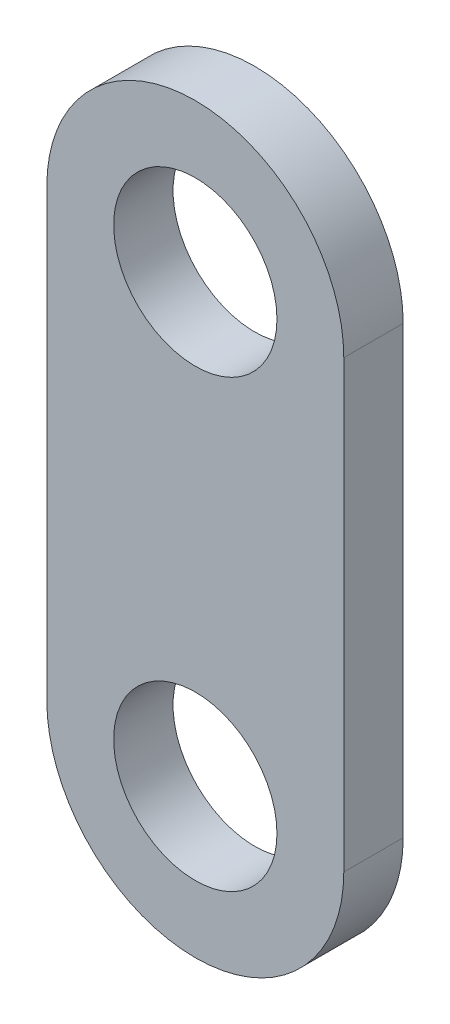
ISO-10303-21;
HEADER;
FILE_DESCRIPTION(('STEP AP214'),'2;1');
FILE_NAME('part.step','',(''),(''),'','','');
FILE_SCHEMA(('AUTOMOTIVE_DESIGN { 1 0 10303 214 1 1 1 1 }'));
ENDSEC;
DATA;
#1=APPLICATION_CONTEXT('core data for automotive mechanical design processes');
#2=APPLICATION_PROTOCOL_DEFINITION('international standard','automotive_design',2000,#1);
#3=PRODUCT_CONTEXT('',#1,'mechanical');
#4=PRODUCT('Part','Part','',(#3));
#5=PRODUCT_RELATED_PRODUCT_CATEGORY('part','',(#4));
#6=PRODUCT_DEFINITION_FORMATION('','',#4);
#7=PRODUCT_DEFINITION_CONTEXT('part definition',#1,'design');
#8=PRODUCT_DEFINITION('design','',#6,#7);
#9=PRODUCT_DEFINITION_SHAPE('','',#8);
#10=(LENGTH_UNIT() NAMED_UNIT(*) SI_UNIT(.MILLI.,.METRE.));
#11=(NAMED_UNIT(*) PLANE_ANGLE_UNIT() SI_UNIT($,.RADIAN.));
#12=(NAMED_UNIT(*) SI_UNIT($,.STERADIAN.) SOLID_ANGLE_UNIT());
#13=UNCERTAINTY_MEASURE_WITH_UNIT(LENGTH_MEASURE(1.E-05),#10,'distance_accuracy_value','');
#14=(GEOMETRIC_REPRESENTATION_CONTEXT(3) GLOBAL_UNCERTAINTY_ASSIGNED_CONTEXT((#13)) GLOBAL_UNIT_ASSIGNED_CONTEXT((#10,
#11,#12)) REPRESENTATION_CONTEXT('',''));
#15=CARTESIAN_POINT('',(0.,0.,0.));
#16=DIRECTION('',(0.,0.,1.));
#17=DIRECTION('',(1.,0.,0.));
#18=AXIS2_PLACEMENT_3D('',#15,#16,#17);
#19=CARTESIAN_POINT('',(0.,7.5,2.));
#20=DIRECTION('',(0.,0.,-1.));
#21=DIRECTION('',(-1.,0.,0.));
#22=AXIS2_PLACEMENT_3D('',#19,#20,#21);
#23=CYLINDRICAL_SURFACE('',#22,5.);
#24=CARTESIAN_POINT('',(0.,7.5,0.));
#25=DIRECTION('',(0.,0.,1.));
#26=DIRECTION('',(1.,0.,0.));
#27=AXIS2_PLACEMENT_3D('',#24,#25,#26);
#28=CIRCLE('',#27,5.);
#29=CARTESIAN_POINT('',(4.99999999999999,7.5,0.));
#30=VERTEX_POINT('',#29);
#31=CARTESIAN_POINT('',(-5.,7.49999999999999,0.));
#32=VERTEX_POINT('',#31);
#33=EDGE_CURVE('E105',#30,#32,#28,.T.);
#34=ORIENTED_EDGE('',*,*,#33,.T.);
#35=DIRECTION('',(0.,0.,-1.));
#36=VECTOR('',#35,1.);
#37=CARTESIAN_POINT('',(-5.,7.49999999999999,2.));
#38=LINE('',#37,#36);
#39=CARTESIAN_POINT('',(-5.,7.49999999999999,2.));
#40=VERTEX_POINT('',#39);
#41=EDGE_CURVE('E11',#40,#32,#38,.T.);
#42=ORIENTED_EDGE('',*,*,#41,.F.);
#43=CARTESIAN_POINT('',(0.,7.5,2.));
#44=DIRECTION('',(0.,0.,1.));
#45=DIRECTION('',(1.,0.,0.));
#46=AXIS2_PLACEMENT_3D('',#43,#44,#45);
#47=CIRCLE('',#46,5.);
#48=CARTESIAN_POINT('',(4.99999999999999,7.5,2.));
#49=VERTEX_POINT('',#48);
#50=EDGE_CURVE('E93',#49,#40,#47,.T.);
#51=ORIENTED_EDGE('',*,*,#50,.F.);
#52=DIRECTION('',(0.,0.,-1.));
#53=VECTOR('',#52,1.);
#54=CARTESIAN_POINT('',(4.99999999999999,7.5,2.));
#55=LINE('',#54,#53);
#56=EDGE_CURVE('E101',#49,#30,#55,.T.);
#57=ORIENTED_EDGE('',*,*,#56,.T.);
#58=EDGE_LOOP('',(#34,#42,#51,#57));
#59=FACE_BOUND('',#58,.T.);
#60=ADVANCED_FACE('F42',(#59),#23,.T.);
#61=CARTESIAN_POINT('',(-5.,7.49999999999999,2.));
#62=DIRECTION('',(1.,0.,0.));
#63=DIRECTION('',(0.,1.,0.));
#64=AXIS2_PLACEMENT_3D('',#61,#62,#63);
#65=PLANE('',#64);
#66=DIRECTION('',(0.,-1.,0.));
#67=VECTOR('',#66,1.);
#68=CARTESIAN_POINT('',(-5.,7.49999999999999,0.));
#69=LINE('',#68,#67);
#70=CARTESIAN_POINT('',(-5.,-7.5,0.));
#71=VERTEX_POINT('',#70);
#72=EDGE_CURVE('E97',#32,#71,#69,.T.);
#73=ORIENTED_EDGE('',*,*,#72,.T.);
#74=DIRECTION('',(0.,0.,-1.));
#75=VECTOR('',#74,1.);
#76=CARTESIAN_POINT('',(-5.,-7.5,2.));
#77=LINE('',#76,#75);
#78=CARTESIAN_POINT('',(-5.,-7.5,2.));
#79=VERTEX_POINT('',#78);
#80=EDGE_CURVE('E50',#79,#71,#77,.T.);
#81=ORIENTED_EDGE('',*,*,#80,.F.);
#82=DIRECTION('',(0.,-1.,0.));
#83=VECTOR('',#82,1.);
#84=CARTESIAN_POINT('',(-5.,7.49999999999999,2.));
#85=LINE('',#84,#83);
#86=EDGE_CURVE('E88',#40,#79,#85,.T.);
#87=ORIENTED_EDGE('',*,*,#86,.F.);
#88=ORIENTED_EDGE('',*,*,#41,.T.);
#89=EDGE_LOOP('',(#73,#81,#87,#88));
#90=FACE_BOUND('',#89,.T.);
#91=ADVANCED_FACE('F96',(#90),#65,.F.);
#92=CARTESIAN_POINT('',(0.,-7.5,2.));
#93=DIRECTION('',(0.,0.,-1.));
#94=DIRECTION('',(-1.,0.,0.));
#95=AXIS2_PLACEMENT_3D('',#92,#93,#94);
#96=CYLINDRICAL_SURFACE('',#95,5.);
#97=CARTESIAN_POINT('',(0.,-7.5,0.));
#98=DIRECTION('',(0.,0.,1.));
#99=DIRECTION('',(1.,0.,0.));
#100=AXIS2_PLACEMENT_3D('',#97,#98,#99);
#101=CIRCLE('',#100,5.);
#102=CARTESIAN_POINT('',(5.,-7.5,0.));
#103=VERTEX_POINT('',#102);
#104=EDGE_CURVE('E75',#71,#103,#101,.T.);
#105=ORIENTED_EDGE('',*,*,#104,.T.);
#106=DIRECTION('',(0.,0.,-1.));
#107=VECTOR('',#106,1.);
#108=CARTESIAN_POINT('',(5.,-7.5,2.));
#109=LINE('',#108,#107);
#110=CARTESIAN_POINT('',(5.,-7.5,2.));
#111=VERTEX_POINT('',#110);
#112=EDGE_CURVE('E98',#111,#103,#109,.T.);
#113=ORIENTED_EDGE('',*,*,#112,.F.);
#114=CARTESIAN_POINT('',(0.,-7.5,2.));
#115=DIRECTION('',(0.,0.,1.));
#116=DIRECTION('',(1.,0.,0.));
#117=AXIS2_PLACEMENT_3D('',#114,#115,#116);
#118=CIRCLE('',#117,5.);
#119=EDGE_CURVE('E91',#79,#111,#118,.T.);
#120=ORIENTED_EDGE('',*,*,#119,.F.);
#121=ORIENTED_EDGE('',*,*,#80,.T.);
#122=EDGE_LOOP('',(#105,#113,#120,#121));
#123=FACE_BOUND('',#122,.T.);
#124=ADVANCED_FACE('F99',(#123),#96,.T.);
#125=CARTESIAN_POINT('',(4.99999999999999,7.5,2.));
#126=DIRECTION('',(-1.,0.,0.));
#127=DIRECTION('',(0.,-1.,0.));
#128=AXIS2_PLACEMENT_3D('',#125,#126,#127);
#129=PLANE('',#128);
#130=DIRECTION('',(0.,1.,0.));
#131=VECTOR('',#130,1.);
#132=CARTESIAN_POINT('',(4.99999999999999,7.5,0.));
#133=LINE('',#132,#131);
#134=EDGE_CURVE('E81',#103,#30,#133,.T.);
#135=ORIENTED_EDGE('',*,*,#134,.T.);
#136=ORIENTED_EDGE('',*,*,#56,.F.);
#137=DIRECTION('',(0.,1.,0.));
#138=VECTOR('',#137,1.);
#139=CARTESIAN_POINT('',(4.99999999999999,7.5,2.));
#140=LINE('',#139,#138);
#141=EDGE_CURVE('E58',#111,#49,#140,.T.);
#142=ORIENTED_EDGE('',*,*,#141,.F.);
#143=ORIENTED_EDGE('',*,*,#112,.T.);
#144=EDGE_LOOP('',(#135,#136,#142,#143));
#145=FACE_BOUND('',#144,.T.);
#146=ADVANCED_FACE('F113',(#145),#129,.F.);
#147=CARTESIAN_POINT('',(0.,7.5,2.));
#148=DIRECTION('',(0.,0.,1.));
#149=DIRECTION('',(1.,0.,0.));
#150=AXIS2_PLACEMENT_3D('',#147,#148,#149);
#151=PLANE('',#150);
#152=CARTESIAN_POINT('',(0.,7.5,2.));
#153=DIRECTION('',(0.,0.,1.));
#154=DIRECTION('',(1.,0.,0.));
#155=AXIS2_PLACEMENT_3D('',#152,#153,#154);
#156=CIRCLE('',#155,2.75);
#157=CARTESIAN_POINT('',(2.75,7.5,2.));
#158=VERTEX_POINT('',#157);
#159=EDGE_CURVE('E127',#158,#158,#156,.T.);
#160=ORIENTED_EDGE('',*,*,#159,.F.);
#161=EDGE_LOOP('',(#160));
#162=FACE_BOUND('',#161,.T.);
#163=CARTESIAN_POINT('',(0.,-7.5,2.));
#164=DIRECTION('',(0.,0.,1.));
#165=DIRECTION('',(1.,0.,0.));
#166=AXIS2_PLACEMENT_3D('',#163,#164,#165);
#167=CIRCLE('',#166,2.75);
#168=CARTESIAN_POINT('',(2.75,-7.5,2.));
#169=VERTEX_POINT('',#168);
#170=EDGE_CURVE('E121',#169,#169,#167,.T.);
#171=ORIENTED_EDGE('',*,*,#170,.F.);
#172=EDGE_LOOP('',(#171));
#173=FACE_BOUND('',#172,.T.);
#174=ORIENTED_EDGE('',*,*,#50,.T.);
#175=ORIENTED_EDGE('',*,*,#86,.T.);
#176=ORIENTED_EDGE('',*,*,#119,.T.);
#177=ORIENTED_EDGE('',*,*,#141,.T.);
#178=EDGE_LOOP('',(#174,#175,#176,#177));
#179=FACE_BOUND('',#178,.T.);
#180=ADVANCED_FACE('F89',(#162,#173,#179),#151,.T.);
#181=CARTESIAN_POINT('',(0.,7.5,0.));
#182=DIRECTION('',(0.,0.,1.));
#183=DIRECTION('',(1.,0.,0.));
#184=AXIS2_PLACEMENT_3D('',#181,#182,#183);
#185=PLANE('',#184);
#186=CARTESIAN_POINT('',(0.,7.5,0.));
#187=DIRECTION('',(0.,0.,1.));
#188=DIRECTION('',(1.,0.,0.));
#189=AXIS2_PLACEMENT_3D('',#186,#187,#188);
#190=CIRCLE('',#189,2.75);
#191=CARTESIAN_POINT('',(2.75,7.5,0.));
#192=VERTEX_POINT('',#191);
#193=EDGE_CURVE('E124',#192,#192,#190,.T.);
#194=ORIENTED_EDGE('',*,*,#193,.T.);
#195=EDGE_LOOP('',(#194));
#196=FACE_BOUND('',#195,.T.);
#197=CARTESIAN_POINT('',(0.,-7.5,0.));
#198=DIRECTION('',(0.,0.,1.));
#199=DIRECTION('',(1.,0.,0.));
#200=AXIS2_PLACEMENT_3D('',#197,#198,#199);
#201=CIRCLE('',#200,2.75);
#202=CARTESIAN_POINT('',(2.75,-7.5,0.));
#203=VERTEX_POINT('',#202);
#204=EDGE_CURVE('E108',#203,#203,#201,.T.);
#205=ORIENTED_EDGE('',*,*,#204,.T.);
#206=EDGE_LOOP('',(#205));
#207=FACE_BOUND('',#206,.T.);
#208=ORIENTED_EDGE('',*,*,#33,.F.);
#209=ORIENTED_EDGE('',*,*,#134,.F.);
#210=ORIENTED_EDGE('',*,*,#104,.F.);
#211=ORIENTED_EDGE('',*,*,#72,.F.);
#212=EDGE_LOOP('',(#208,#209,#210,#211));
#213=FACE_BOUND('',#212,.T.);
#214=ADVANCED_FACE('F116',(#196,#207,#213),#185,.F.);
#215=CARTESIAN_POINT('',(0.,-7.5,2.));
#216=DIRECTION('',(0.,0.,1.));
#217=DIRECTION('',(1.,0.,0.));
#218=AXIS2_PLACEMENT_3D('',#215,#216,#217);
#219=CYLINDRICAL_SURFACE('',#218,2.75);
#220=ORIENTED_EDGE('',*,*,#204,.F.);
#221=EDGE_LOOP('',(#220));
#222=FACE_BOUND('',#221,.T.);
#223=ORIENTED_EDGE('',*,*,#170,.T.);
#224=EDGE_LOOP('',(#223));
#225=FACE_BOUND('',#224,.T.);
#226=ADVANCED_FACE('F138',(#222,#225),#219,.F.);
#227=CARTESIAN_POINT('',(0.,7.5,2.));
#228=DIRECTION('',(0.,0.,1.));
#229=DIRECTION('',(1.,0.,0.));
#230=AXIS2_PLACEMENT_3D('',#227,#228,#229);
#231=CYLINDRICAL_SURFACE('',#230,2.75);
#232=ORIENTED_EDGE('',*,*,#193,.F.);
#233=EDGE_LOOP('',(#232));
#234=FACE_BOUND('',#233,.T.);
#235=ORIENTED_EDGE('',*,*,#159,.T.);
#236=EDGE_LOOP('',(#235));
#237=FACE_BOUND('',#236,.T.);
#238=ADVANCED_FACE('F131',(#234,#237),#231,.F.);
#239=CLOSED_SHELL('',(#60,#91,#124,#146,#180,#214,#226,#238));
#240=MANIFOLD_SOLID_BREP('B2',#239);
#241=ADVANCED_BREP_SHAPE_REPRESENTATION('',(#18,#240),#14);
#242=SHAPE_DEFINITION_REPRESENTATION(#9,#241);
ENDSEC;
END-ISO-10303-21;
